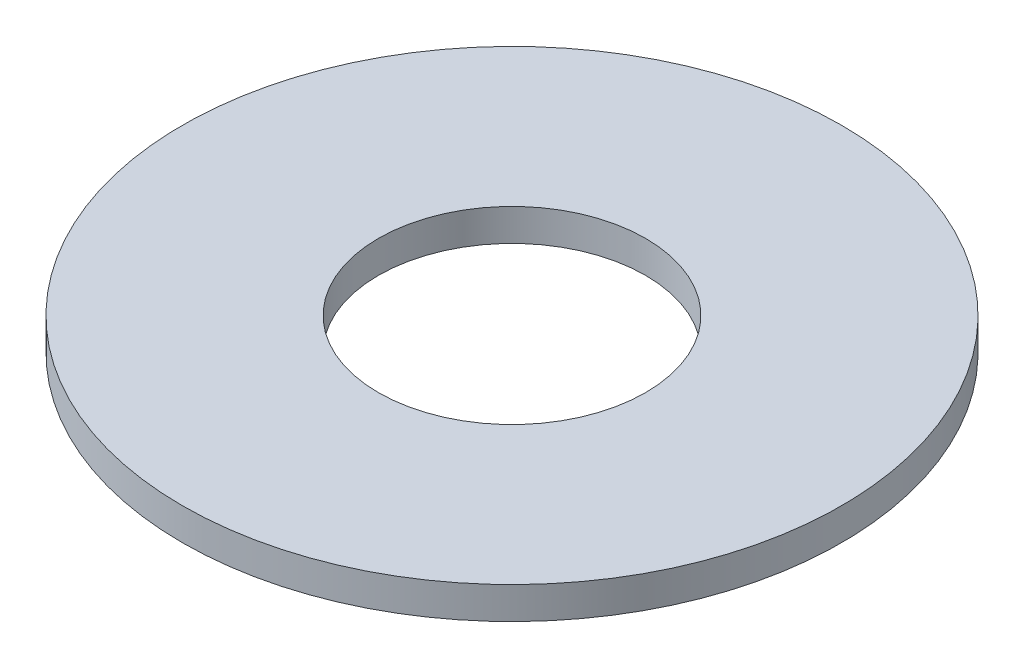
ISO-10303-21;
HEADER;
FILE_DESCRIPTION(('STEP AP214'),'2;1');
FILE_NAME('part.step','',(''),(''),'','','');
FILE_SCHEMA(('AUTOMOTIVE_DESIGN { 1 0 10303 214 1 1 1 1 }'));
ENDSEC;
DATA;
#1=APPLICATION_CONTEXT('core data for automotive mechanical design processes');
#2=APPLICATION_PROTOCOL_DEFINITION('international standard','automotive_design',2000,#1);
#3=PRODUCT_CONTEXT('',#1,'mechanical');
#4=PRODUCT('Part','Part','',(#3));
#5=PRODUCT_RELATED_PRODUCT_CATEGORY('part','',(#4));
#6=PRODUCT_DEFINITION_FORMATION('','',#4);
#7=PRODUCT_DEFINITION_CONTEXT('part definition',#1,'design');
#8=PRODUCT_DEFINITION('design','',#6,#7);
#9=PRODUCT_DEFINITION_SHAPE('','',#8);
#10=(LENGTH_UNIT() NAMED_UNIT(*) SI_UNIT(.MILLI.,.METRE.));
#11=(NAMED_UNIT(*) PLANE_ANGLE_UNIT() SI_UNIT($,.RADIAN.));
#12=(NAMED_UNIT(*) SI_UNIT($,.STERADIAN.) SOLID_ANGLE_UNIT());
#13=UNCERTAINTY_MEASURE_WITH_UNIT(LENGTH_MEASURE(1.E-05),#10,'distance_accuracy_value','');
#14=(GEOMETRIC_REPRESENTATION_CONTEXT(3) GLOBAL_UNCERTAINTY_ASSIGNED_CONTEXT((#13)) GLOBAL_UNIT_ASSIGNED_CONTEXT((#10,
#11,#12)) REPRESENTATION_CONTEXT('',''));
#15=CARTESIAN_POINT('',(0.,0.,0.));
#16=DIRECTION('',(0.,0.,1.));
#17=DIRECTION('',(1.,0.,0.));
#18=AXIS2_PLACEMENT_3D('',#15,#16,#17);
#19=CARTESIAN_POINT('',(0.,9.,0.));
#20=DIRECTION('',(0.,-1.,0.));
#21=DIRECTION('',(0.,0.,-1.));
#22=AXIS2_PLACEMENT_3D('',#19,#20,#21);
#23=CYLINDRICAL_SURFACE('',#22,92.5);
#24=CARTESIAN_POINT('',(0.,9.,0.));
#25=DIRECTION('',(0.,1.,0.));
#26=DIRECTION('',(0.,0.,1.));
#27=AXIS2_PLACEMENT_3D('',#24,#25,#26);
#28=CIRCLE('',#27,92.5);
#29=CARTESIAN_POINT('',(0.,9.,92.5));
#30=VERTEX_POINT('',#29);
#31=EDGE_CURVE('E10',#30,#30,#28,.T.);
#32=ORIENTED_EDGE('',*,*,#31,.F.);
#33=EDGE_LOOP('',(#32));
#34=FACE_BOUND('',#33,.T.);
#35=CARTESIAN_POINT('',(0.,0.,0.));
#36=DIRECTION('',(0.,1.,0.));
#37=DIRECTION('',(0.,0.,1.));
#38=AXIS2_PLACEMENT_3D('',#35,#36,#37);
#39=CIRCLE('',#38,92.5);
#40=CARTESIAN_POINT('',(0.,0.,92.5));
#41=VERTEX_POINT('',#40);
#42=EDGE_CURVE('E37',#41,#41,#39,.T.);
#43=ORIENTED_EDGE('',*,*,#42,.T.);
#44=EDGE_LOOP('',(#43));
#45=FACE_BOUND('',#44,.T.);
#46=ADVANCED_FACE('F40',(#34,#45),#23,.T.);
#47=CARTESIAN_POINT('',(0.,9.,0.));
#48=DIRECTION('',(0.,1.,0.));
#49=DIRECTION('',(0.,0.,1.));
#50=AXIS2_PLACEMENT_3D('',#47,#48,#49);
#51=PLANE('',#50);
#52=CARTESIAN_POINT('',(0.,9.,0.));
#53=DIRECTION('',(0.,1.,0.));
#54=DIRECTION('',(0.,0.,1.));
#55=AXIS2_PLACEMENT_3D('',#52,#53,#54);
#56=CIRCLE('',#55,37.5);
#57=CARTESIAN_POINT('',(0.,9.,37.5));
#58=VERTEX_POINT('',#57);
#59=EDGE_CURVE('E50',#58,#58,#56,.T.);
#60=ORIENTED_EDGE('',*,*,#59,.F.);
#61=EDGE_LOOP('',(#60));
#62=FACE_BOUND('',#61,.T.);
#63=ORIENTED_EDGE('',*,*,#31,.T.);
#64=EDGE_LOOP('',(#63));
#65=FACE_BOUND('',#64,.T.);
#66=ADVANCED_FACE('F59',(#62,#65),#51,.T.);
#67=CARTESIAN_POINT('',(0.,0.,0.));
#68=DIRECTION('',(0.,1.,0.));
#69=DIRECTION('',(0.,0.,1.));
#70=AXIS2_PLACEMENT_3D('',#67,#68,#69);
#71=PLANE('',#70);
#72=CARTESIAN_POINT('',(0.,0.,0.));
#73=DIRECTION('',(0.,1.,0.));
#74=DIRECTION('',(0.,0.,1.));
#75=AXIS2_PLACEMENT_3D('',#72,#73,#74);
#76=CIRCLE('',#75,37.5);
#77=CARTESIAN_POINT('',(0.,0.,37.5));
#78=VERTEX_POINT('',#77);
#79=EDGE_CURVE('E47',#78,#78,#76,.T.);
#80=ORIENTED_EDGE('',*,*,#79,.T.);
#81=EDGE_LOOP('',(#80));
#82=FACE_BOUND('',#81,.T.);
#83=ORIENTED_EDGE('',*,*,#42,.F.);
#84=EDGE_LOOP('',(#83));
#85=FACE_BOUND('',#84,.T.);
#86=ADVANCED_FACE('F58',(#82,#85),#71,.F.);
#87=CARTESIAN_POINT('',(0.,9.,0.));
#88=DIRECTION('',(0.,-1.,0.));
#89=DIRECTION('',(0.,0.,-1.));
#90=AXIS2_PLACEMENT_3D('',#87,#88,#89);
#91=CYLINDRICAL_SURFACE('',#90,37.5);
#92=ORIENTED_EDGE('',*,*,#59,.T.);
#93=EDGE_LOOP('',(#92));
#94=FACE_BOUND('',#93,.T.);
#95=ORIENTED_EDGE('',*,*,#79,.F.);
#96=EDGE_LOOP('',(#95));
#97=FACE_BOUND('',#96,.T.);
#98=ADVANCED_FACE('F54',(#94,#97),#91,.F.);
#99=CLOSED_SHELL('',(#46,#66,#86,#98));
#100=MANIFOLD_SOLID_BREP('B2',#99);
#101=ADVANCED_BREP_SHAPE_REPRESENTATION('',(#18,#100),#14);
#102=SHAPE_DEFINITION_REPRESENTATION(#9,#101);
ENDSEC;
END-ISO-10303-21;
